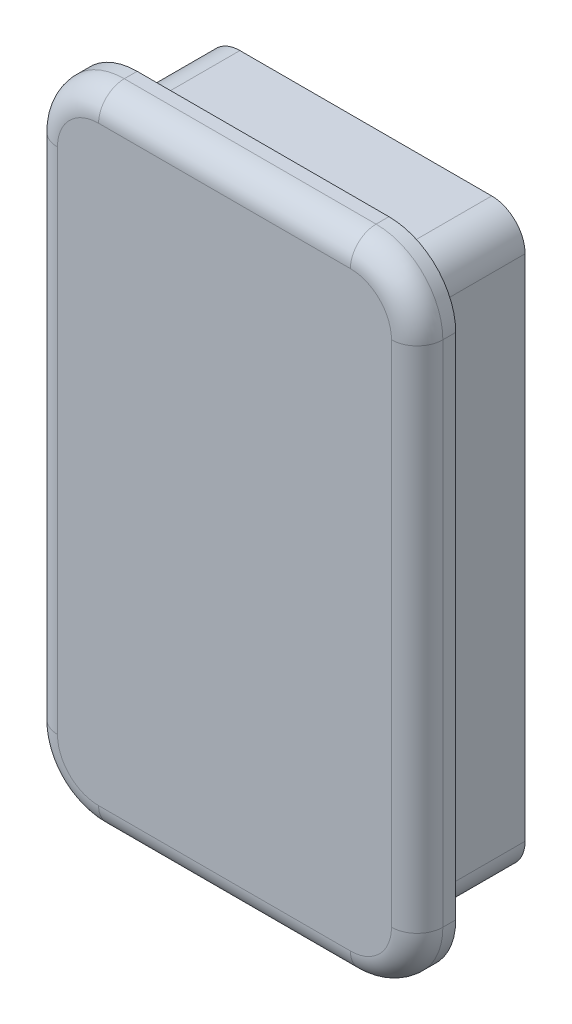
ISO-10303-21;
HEADER;
FILE_DESCRIPTION(('STEP AP214'),'2;1');
FILE_NAME('part.step','',(''),(''),'','','');
FILE_SCHEMA(('AUTOMOTIVE_DESIGN { 1 0 10303 214 1 1 1 1 }'));
ENDSEC;
DATA;
#1=APPLICATION_CONTEXT('core data for automotive mechanical design processes');
#2=APPLICATION_PROTOCOL_DEFINITION('international standard','automotive_design',2000,#1);
#3=PRODUCT_CONTEXT('',#1,'mechanical');
#4=PRODUCT('Part','Part','',(#3));
#5=PRODUCT_RELATED_PRODUCT_CATEGORY('part','',(#4));
#6=PRODUCT_DEFINITION_FORMATION('','',#4);
#7=PRODUCT_DEFINITION_CONTEXT('part definition',#1,'design');
#8=PRODUCT_DEFINITION('design','',#6,#7);
#9=PRODUCT_DEFINITION_SHAPE('','',#8);
#10=(LENGTH_UNIT() NAMED_UNIT(*) SI_UNIT(.MILLI.,.METRE.));
#11=(NAMED_UNIT(*) PLANE_ANGLE_UNIT() SI_UNIT($,.RADIAN.));
#12=(NAMED_UNIT(*) SI_UNIT($,.STERADIAN.) SOLID_ANGLE_UNIT());
#13=UNCERTAINTY_MEASURE_WITH_UNIT(LENGTH_MEASURE(1.E-05),#10,'distance_accuracy_value','');
#14=(GEOMETRIC_REPRESENTATION_CONTEXT(3) GLOBAL_UNCERTAINTY_ASSIGNED_CONTEXT((#13)) GLOBAL_UNIT_ASSIGNED_CONTEXT((#10,
#11,#12)) REPRESENTATION_CONTEXT('',''));
#15=CARTESIAN_POINT('',(0.,0.,0.));
#16=DIRECTION('',(0.,0.,1.));
#17=DIRECTION('',(1.,0.,0.));
#18=AXIS2_PLACEMENT_3D('',#15,#16,#17);
#19=CARTESIAN_POINT('',(9.8,19.8,-8.));
#20=DIRECTION('',(0.,0.,1.));
#21=DIRECTION('',(1.,0.,0.));
#22=AXIS2_PLACEMENT_3D('',#19,#20,#21);
#23=CYLINDRICAL_SURFACE('',#22,2.6);
#24=CARTESIAN_POINT('',(9.8,19.8,0.));
#25=DIRECTION('',(0.,0.,1.));
#26=DIRECTION('',(1.,0.,0.));
#27=AXIS2_PLACEMENT_3D('',#24,#25,#26);
#28=CIRCLE('',#27,2.6);
#29=CARTESIAN_POINT('',(12.4,19.8,0.));
#30=VERTEX_POINT('',#29);
#31=CARTESIAN_POINT('',(9.8,22.4,0.));
#32=VERTEX_POINT('',#31);
#33=EDGE_CURVE('E419',#30,#32,#28,.T.);
#34=ORIENTED_EDGE('',*,*,#33,.F.);
#35=DIRECTION('',(0.,0.,1.));
#36=VECTOR('',#35,1.);
#37=CARTESIAN_POINT('',(12.4,19.8,-8.));
#38=LINE('',#37,#36);
#39=CARTESIAN_POINT('',(12.4,19.8,-8.));
#40=VERTEX_POINT('',#39);
#41=EDGE_CURVE('E476',#40,#30,#38,.T.);
#42=ORIENTED_EDGE('',*,*,#41,.F.);
#43=CARTESIAN_POINT('',(9.8,19.8,-8.));
#44=DIRECTION('',(0.,0.,1.));
#45=DIRECTION('',(1.,0.,0.));
#46=AXIS2_PLACEMENT_3D('',#43,#44,#45);
#47=CIRCLE('',#46,2.6);
#48=CARTESIAN_POINT('',(9.8,22.4,-8.));
#49=VERTEX_POINT('',#48);
#50=EDGE_CURVE('E420',#40,#49,#47,.T.);
#51=ORIENTED_EDGE('',*,*,#50,.T.);
#52=DIRECTION('',(0.,0.,1.));
#53=VECTOR('',#52,1.);
#54=CARTESIAN_POINT('',(9.8,22.4,-8.));
#55=LINE('',#54,#53);
#56=EDGE_CURVE('E451',#49,#32,#55,.T.);
#57=ORIENTED_EDGE('',*,*,#56,.T.);
#58=EDGE_LOOP('',(#34,#42,#51,#57));
#59=FACE_BOUND('',#58,.T.);
#60=ADVANCED_FACE('F38',(#59),#23,.T.);
#61=CARTESIAN_POINT('',(12.4,19.8,-8.));
#62=DIRECTION('',(-1.,0.,0.));
#63=DIRECTION('',(0.,0.,1.));
#64=AXIS2_PLACEMENT_3D('',#61,#62,#63);
#65=PLANE('',#64);
#66=DIRECTION('',(0.,-1.,0.));
#67=VECTOR('',#66,1.);
#68=CARTESIAN_POINT('',(12.4,19.8,0.));
#69=LINE('',#68,#67);
#70=CARTESIAN_POINT('',(12.4,-19.8,0.));
#71=VERTEX_POINT('',#70);
#72=EDGE_CURVE('E425',#30,#71,#69,.T.);
#73=ORIENTED_EDGE('',*,*,#72,.T.);
#74=DIRECTION('',(0.,0.,1.));
#75=VECTOR('',#74,1.);
#76=CARTESIAN_POINT('',(12.4,-19.8,-8.));
#77=LINE('',#76,#75);
#78=CARTESIAN_POINT('',(12.4,-19.8,-8.));
#79=VERTEX_POINT('',#78);
#80=EDGE_CURVE('E481',#79,#71,#77,.T.);
#81=ORIENTED_EDGE('',*,*,#80,.F.);
#82=DIRECTION('',(0.,-1.,0.));
#83=VECTOR('',#82,1.);
#84=CARTESIAN_POINT('',(12.4,19.8,-8.));
#85=LINE('',#84,#83);
#86=EDGE_CURVE('E448',#40,#79,#85,.T.);
#87=ORIENTED_EDGE('',*,*,#86,.F.);
#88=ORIENTED_EDGE('',*,*,#41,.T.);
#89=EDGE_LOOP('',(#73,#81,#87,#88));
#90=FACE_BOUND('',#89,.T.);
#91=ADVANCED_FACE('F660',(#90),#65,.F.);
#92=CARTESIAN_POINT('',(9.8,-19.8,-8.));
#93=DIRECTION('',(0.,0.,1.));
#94=DIRECTION('',(1.,0.,0.));
#95=AXIS2_PLACEMENT_3D('',#92,#93,#94);
#96=CYLINDRICAL_SURFACE('',#95,2.6);
#97=CARTESIAN_POINT('',(9.8,-19.8,0.));
#98=DIRECTION('',(0.,0.,1.));
#99=DIRECTION('',(1.,0.,0.));
#100=AXIS2_PLACEMENT_3D('',#97,#98,#99);
#101=CIRCLE('',#100,2.6);
#102=CARTESIAN_POINT('',(9.8,-22.4,0.));
#103=VERTEX_POINT('',#102);
#104=EDGE_CURVE('E470',#103,#71,#101,.T.);
#105=ORIENTED_EDGE('',*,*,#104,.F.);
#106=DIRECTION('',(0.,0.,1.));
#107=VECTOR('',#106,1.);
#108=CARTESIAN_POINT('',(9.8,-22.4,-8.));
#109=LINE('',#108,#107);
#110=CARTESIAN_POINT('',(9.8,-22.4,-8.));
#111=VERTEX_POINT('',#110);
#112=EDGE_CURVE('E485',#111,#103,#109,.T.);
#113=ORIENTED_EDGE('',*,*,#112,.F.);
#114=CARTESIAN_POINT('',(9.8,-19.8,-8.));
#115=DIRECTION('',(0.,0.,1.));
#116=DIRECTION('',(1.,0.,0.));
#117=AXIS2_PLACEMENT_3D('',#114,#115,#116);
#118=CIRCLE('',#117,2.6);
#119=EDGE_CURVE('E444',#111,#79,#118,.T.);
#120=ORIENTED_EDGE('',*,*,#119,.T.);
#121=ORIENTED_EDGE('',*,*,#80,.T.);
#122=EDGE_LOOP('',(#105,#113,#120,#121));
#123=FACE_BOUND('',#122,.T.);
#124=ADVANCED_FACE('F665',(#123),#96,.T.);
#125=CARTESIAN_POINT('',(-9.8,-22.4,-8.));
#126=DIRECTION('',(0.,-1.,0.));
#127=DIRECTION('',(0.,0.,-1.));
#128=AXIS2_PLACEMENT_3D('',#125,#126,#127);
#129=PLANE('',#128);
#130=DIRECTION('',(1.,0.,0.));
#131=VECTOR('',#130,1.);
#132=CARTESIAN_POINT('',(-9.8,-22.4,0.));
#133=LINE('',#132,#131);
#134=CARTESIAN_POINT('',(-9.8,-22.4,0.));
#135=VERTEX_POINT('',#134);
#136=EDGE_CURVE('E467',#135,#103,#133,.T.);
#137=ORIENTED_EDGE('',*,*,#136,.F.);
#138=DIRECTION('',(0.,0.,1.));
#139=VECTOR('',#138,1.);
#140=CARTESIAN_POINT('',(-9.8,-22.4,-8.));
#141=LINE('',#140,#139);
#142=CARTESIAN_POINT('',(-9.8,-22.4,-8.));
#143=VERTEX_POINT('',#142);
#144=EDGE_CURVE('E489',#143,#135,#141,.T.);
#145=ORIENTED_EDGE('',*,*,#144,.F.);
#146=DIRECTION('',(1.,0.,0.));
#147=VECTOR('',#146,1.);
#148=CARTESIAN_POINT('',(-9.8,-22.4,-8.));
#149=LINE('',#148,#147);
#150=EDGE_CURVE('E440',#143,#111,#149,.T.);
#151=ORIENTED_EDGE('',*,*,#150,.T.);
#152=ORIENTED_EDGE('',*,*,#112,.T.);
#153=EDGE_LOOP('',(#137,#145,#151,#152));
#154=FACE_BOUND('',#153,.T.);
#155=ADVANCED_FACE('F685',(#154),#129,.T.);
#156=CARTESIAN_POINT('',(-9.8,-19.8,-8.));
#157=DIRECTION('',(0.,0.,1.));
#158=DIRECTION('',(1.,0.,0.));
#159=AXIS2_PLACEMENT_3D('',#156,#157,#158);
#160=CYLINDRICAL_SURFACE('',#159,2.6);
#161=CARTESIAN_POINT('',(-9.8,-19.8,0.));
#162=DIRECTION('',(0.,0.,1.));
#163=DIRECTION('',(1.,0.,0.));
#164=AXIS2_PLACEMENT_3D('',#161,#162,#163);
#165=CIRCLE('',#164,2.6);
#166=CARTESIAN_POINT('',(-12.4,-19.8,0.));
#167=VERTEX_POINT('',#166);
#168=EDGE_CURVE('E464',#167,#135,#165,.T.);
#169=ORIENTED_EDGE('',*,*,#168,.F.);
#170=DIRECTION('',(0.,0.,1.));
#171=VECTOR('',#170,1.);
#172=CARTESIAN_POINT('',(-12.4,-19.8,-8.));
#173=LINE('',#172,#171);
#174=CARTESIAN_POINT('',(-12.4,-19.8,-8.));
#175=VERTEX_POINT('',#174);
#176=EDGE_CURVE('E493',#175,#167,#173,.T.);
#177=ORIENTED_EDGE('',*,*,#176,.F.);
#178=CARTESIAN_POINT('',(-9.8,-19.8,-8.));
#179=DIRECTION('',(0.,0.,1.));
#180=DIRECTION('',(1.,0.,0.));
#181=AXIS2_PLACEMENT_3D('',#178,#179,#180);
#182=CIRCLE('',#181,2.6);
#183=EDGE_CURVE('E436',#175,#143,#182,.T.);
#184=ORIENTED_EDGE('',*,*,#183,.T.);
#185=ORIENTED_EDGE('',*,*,#144,.T.);
#186=EDGE_LOOP('',(#169,#177,#184,#185));
#187=FACE_BOUND('',#186,.T.);
#188=ADVANCED_FACE('F681',(#187),#160,.T.);
#189=CARTESIAN_POINT('',(-12.4,-19.8,-8.));
#190=DIRECTION('',(1.,0.,0.));
#191=DIRECTION('',(0.,0.,-1.));
#192=AXIS2_PLACEMENT_3D('',#189,#190,#191);
#193=PLANE('',#192);
#194=DIRECTION('',(0.,1.,0.));
#195=VECTOR('',#194,1.);
#196=CARTESIAN_POINT('',(-12.4,-19.8,0.));
#197=LINE('',#196,#195);
#198=CARTESIAN_POINT('',(-12.4,19.8,0.));
#199=VERTEX_POINT('',#198);
#200=EDGE_CURVE('E460',#167,#199,#197,.T.);
#201=ORIENTED_EDGE('',*,*,#200,.T.);
#202=DIRECTION('',(0.,0.,1.));
#203=VECTOR('',#202,1.);
#204=CARTESIAN_POINT('',(-12.4,19.8,-8.));
#205=LINE('',#204,#203);
#206=CARTESIAN_POINT('',(-12.4,19.8,-8.));
#207=VERTEX_POINT('',#206);
#208=EDGE_CURVE('E497',#207,#199,#205,.T.);
#209=ORIENTED_EDGE('',*,*,#208,.F.);
#210=DIRECTION('',(0.,1.,0.));
#211=VECTOR('',#210,1.);
#212=CARTESIAN_POINT('',(-12.4,-19.8,-8.));
#213=LINE('',#212,#211);
#214=EDGE_CURVE('E433',#175,#207,#213,.T.);
#215=ORIENTED_EDGE('',*,*,#214,.F.);
#216=ORIENTED_EDGE('',*,*,#176,.T.);
#217=EDGE_LOOP('',(#201,#209,#215,#216));
#218=FACE_BOUND('',#217,.T.);
#219=ADVANCED_FACE('F677',(#218),#193,.F.);
#220=CARTESIAN_POINT('',(-9.8,19.8,-8.));
#221=DIRECTION('',(0.,0.,1.));
#222=DIRECTION('',(1.,0.,0.));
#223=AXIS2_PLACEMENT_3D('',#220,#221,#222);
#224=CYLINDRICAL_SURFACE('',#223,2.6);
#225=CARTESIAN_POINT('',(-9.8,19.8,0.));
#226=DIRECTION('',(0.,0.,1.));
#227=DIRECTION('',(1.,0.,0.));
#228=AXIS2_PLACEMENT_3D('',#225,#226,#227);
#229=CIRCLE('',#228,2.6);
#230=CARTESIAN_POINT('',(-9.8,22.4,0.));
#231=VERTEX_POINT('',#230);
#232=EDGE_CURVE('E457',#231,#199,#229,.T.);
#233=ORIENTED_EDGE('',*,*,#232,.F.);
#234=DIRECTION('',(0.,0.,1.));
#235=VECTOR('',#234,1.);
#236=CARTESIAN_POINT('',(-9.8,22.4,-8.));
#237=LINE('',#236,#235);
#238=CARTESIAN_POINT('',(-9.8,22.4,-8.));
#239=VERTEX_POINT('',#238);
#240=EDGE_CURVE('E501',#239,#231,#237,.T.);
#241=ORIENTED_EDGE('',*,*,#240,.F.);
#242=CARTESIAN_POINT('',(-9.8,19.8,-8.));
#243=DIRECTION('',(0.,0.,1.));
#244=DIRECTION('',(1.,0.,0.));
#245=AXIS2_PLACEMENT_3D('',#242,#243,#244);
#246=CIRCLE('',#245,2.6);
#247=EDGE_CURVE('E429',#239,#207,#246,.T.);
#248=ORIENTED_EDGE('',*,*,#247,.T.);
#249=ORIENTED_EDGE('',*,*,#208,.T.);
#250=EDGE_LOOP('',(#233,#241,#248,#249));
#251=FACE_BOUND('',#250,.T.);
#252=ADVANCED_FACE('F673',(#251),#224,.T.);
#253=CARTESIAN_POINT('',(9.8,22.4,-8.));
#254=DIRECTION('',(0.,1.,0.));
#255=DIRECTION('',(0.,0.,1.));
#256=AXIS2_PLACEMENT_3D('',#253,#254,#255);
#257=PLANE('',#256);
#258=DIRECTION('',(-1.,0.,0.));
#259=VECTOR('',#258,1.);
#260=CARTESIAN_POINT('',(9.8,22.4,0.));
#261=LINE('',#260,#259);
#262=EDGE_CURVE('E454',#32,#231,#261,.T.);
#263=ORIENTED_EDGE('',*,*,#262,.F.);
#264=ORIENTED_EDGE('',*,*,#56,.F.);
#265=DIRECTION('',(-1.,0.,0.));
#266=VECTOR('',#265,1.);
#267=CARTESIAN_POINT('',(9.8,22.4,-8.));
#268=LINE('',#267,#266);
#269=EDGE_CURVE('E424',#49,#239,#268,.T.);
#270=ORIENTED_EDGE('',*,*,#269,.T.);
#271=ORIENTED_EDGE('',*,*,#240,.T.);
#272=EDGE_LOOP('',(#263,#264,#270,#271));
#273=FACE_BOUND('',#272,.T.);
#274=ADVANCED_FACE('F670',(#273),#257,.T.);
#275=CARTESIAN_POINT('',(9.8,19.8,-8.));
#276=DIRECTION('',(0.,0.,1.));
#277=DIRECTION('',(1.,0.,0.));
#278=AXIS2_PLACEMENT_3D('',#275,#276,#277);
#279=PLANE('',#278);
#280=DIRECTION('',(0.,-1.,0.));
#281=VECTOR('',#280,1.);
#282=CARTESIAN_POINT('',(10.4,19.8,-8.));
#283=LINE('',#282,#281);
#284=CARTESIAN_POINT('',(10.4,19.8,-8.));
#285=VERTEX_POINT('',#284);
#286=CARTESIAN_POINT('',(10.4,-19.8,-8.));
#287=VERTEX_POINT('',#286);
#288=EDGE_CURVE('E287',#285,#287,#283,.T.);
#289=ORIENTED_EDGE('',*,*,#288,.F.);
#290=CARTESIAN_POINT('',(9.8,19.8,-8.));
#291=DIRECTION('',(0.,0.,1.));
#292=DIRECTION('',(1.,0.,0.));
#293=AXIS2_PLACEMENT_3D('',#290,#291,#292);
#294=CIRCLE('',#293,0.599999999999997);
#295=CARTESIAN_POINT('',(9.8,20.4,-8.));
#296=VERTEX_POINT('',#295);
#297=EDGE_CURVE('E296',#285,#296,#294,.T.);
#298=ORIENTED_EDGE('',*,*,#297,.T.);
#299=DIRECTION('',(-1.,0.,0.));
#300=VECTOR('',#299,1.);
#301=CARTESIAN_POINT('',(9.8,20.4,-8.));
#302=LINE('',#301,#300);
#303=CARTESIAN_POINT('',(-9.8,20.4,-8.));
#304=VERTEX_POINT('',#303);
#305=EDGE_CURVE('E304',#296,#304,#302,.T.);
#306=ORIENTED_EDGE('',*,*,#305,.T.);
#307=CARTESIAN_POINT('',(-9.8,19.8,-8.));
#308=DIRECTION('',(0.,0.,1.));
#309=DIRECTION('',(1.,0.,0.));
#310=AXIS2_PLACEMENT_3D('',#307,#308,#309);
#311=CIRCLE('',#310,0.599999999999997);
#312=CARTESIAN_POINT('',(-10.4,19.8,-8.));
#313=VERTEX_POINT('',#312);
#314=EDGE_CURVE('E59',#304,#313,#311,.T.);
#315=ORIENTED_EDGE('',*,*,#314,.T.);
#316=DIRECTION('',(0.,1.,0.));
#317=VECTOR('',#316,1.);
#318=CARTESIAN_POINT('',(-10.4,19.8,-8.));
#319=LINE('',#318,#317);
#320=CARTESIAN_POINT('',(-10.4,-19.8,-8.));
#321=VERTEX_POINT('',#320);
#322=EDGE_CURVE('E330',#321,#313,#319,.T.);
#323=ORIENTED_EDGE('',*,*,#322,.F.);
#324=CARTESIAN_POINT('',(-9.8,-19.8,-8.));
#325=DIRECTION('',(0.,0.,1.));
#326=DIRECTION('',(1.,0.,0.));
#327=AXIS2_PLACEMENT_3D('',#324,#325,#326);
#328=CIRCLE('',#327,0.599999999999997);
#329=CARTESIAN_POINT('',(-9.8,-20.4,-8.));
#330=VERTEX_POINT('',#329);
#331=EDGE_CURVE('E326',#321,#330,#328,.T.);
#332=ORIENTED_EDGE('',*,*,#331,.T.);
#333=DIRECTION('',(1.,0.,0.));
#334=VECTOR('',#333,1.);
#335=CARTESIAN_POINT('',(9.8,-20.4,-8.));
#336=LINE('',#335,#334);
#337=CARTESIAN_POINT('',(9.8,-20.4,-8.));
#338=VERTEX_POINT('',#337);
#339=EDGE_CURVE('E320',#330,#338,#336,.T.);
#340=ORIENTED_EDGE('',*,*,#339,.T.);
#341=CARTESIAN_POINT('',(9.8,-19.8,-8.));
#342=DIRECTION('',(0.,0.,1.));
#343=DIRECTION('',(1.,0.,0.));
#344=AXIS2_PLACEMENT_3D('',#341,#342,#343);
#345=CIRCLE('',#344,0.599999999999997);
#346=EDGE_CURVE('E311',#338,#287,#345,.T.);
#347=ORIENTED_EDGE('',*,*,#346,.T.);
#348=EDGE_LOOP('',(#289,#298,#306,#315,#323,#332,#340,#347));
#349=FACE_BOUND('',#348,.T.);
#350=ORIENTED_EDGE('',*,*,#50,.F.);
#351=ORIENTED_EDGE('',*,*,#86,.T.);
#352=ORIENTED_EDGE('',*,*,#119,.F.);
#353=ORIENTED_EDGE('',*,*,#150,.F.);
#354=ORIENTED_EDGE('',*,*,#183,.F.);
#355=ORIENTED_EDGE('',*,*,#214,.T.);
#356=ORIENTED_EDGE('',*,*,#247,.F.);
#357=ORIENTED_EDGE('',*,*,#269,.F.);
#358=EDGE_LOOP('',(#350,#351,#352,#353,#354,#355,#356,#357));
#359=FACE_BOUND('',#358,.T.);
#360=ADVANCED_FACE('F307',(#349,#359),#279,.F.);
#361=CARTESIAN_POINT('',(9.8,19.8,0.));
#362=DIRECTION('',(0.,0.,1.));
#363=DIRECTION('',(1.,0.,0.));
#364=AXIS2_PLACEMENT_3D('',#361,#362,#363);
#365=PLANE('',#364);
#366=CARTESIAN_POINT('',(9.8,19.8,0.));
#367=DIRECTION('',(0.,0.,1.));
#368=DIRECTION('',(1.,0.,0.));
#369=AXIS2_PLACEMENT_3D('',#366,#367,#368);
#370=CIRCLE('',#369,5.2);
#371=CARTESIAN_POINT('',(15.,19.8,0.));
#372=VERTEX_POINT('',#371);
#373=CARTESIAN_POINT('',(9.8,25.,0.));
#374=VERTEX_POINT('',#373);
#375=EDGE_CURVE('E363',#372,#374,#370,.T.);
#376=ORIENTED_EDGE('',*,*,#375,.F.);
#377=DIRECTION('',(0.,1.,0.));
#378=VECTOR('',#377,1.);
#379=CARTESIAN_POINT('',(15.,19.8,0.));
#380=LINE('',#379,#378);
#381=CARTESIAN_POINT('',(15.,-19.8,0.));
#382=VERTEX_POINT('',#381);
#383=EDGE_CURVE('E391',#382,#372,#380,.T.);
#384=ORIENTED_EDGE('',*,*,#383,.F.);
#385=CARTESIAN_POINT('',(9.8,-19.8,0.));
#386=DIRECTION('',(0.,0.,1.));
#387=DIRECTION('',(1.,0.,0.));
#388=AXIS2_PLACEMENT_3D('',#385,#386,#387);
#389=CIRCLE('',#388,5.2);
#390=CARTESIAN_POINT('',(9.8,-25.,0.));
#391=VERTEX_POINT('',#390);
#392=EDGE_CURVE('E387',#391,#382,#389,.T.);
#393=ORIENTED_EDGE('',*,*,#392,.F.);
#394=DIRECTION('',(1.,0.,0.));
#395=VECTOR('',#394,1.);
#396=CARTESIAN_POINT('',(-9.8,-25.,0.));
#397=LINE('',#396,#395);
#398=CARTESIAN_POINT('',(-9.8,-25.,0.));
#399=VERTEX_POINT('',#398);
#400=EDGE_CURVE('E383',#399,#391,#397,.T.);
#401=ORIENTED_EDGE('',*,*,#400,.F.);
#402=CARTESIAN_POINT('',(-9.8,-19.8,0.));
#403=DIRECTION('',(0.,0.,1.));
#404=DIRECTION('',(1.,0.,0.));
#405=AXIS2_PLACEMENT_3D('',#402,#403,#404);
#406=CIRCLE('',#405,5.2);
#407=CARTESIAN_POINT('',(-15.,-19.8,0.));
#408=VERTEX_POINT('',#407);
#409=EDGE_CURVE('E379',#408,#399,#406,.T.);
#410=ORIENTED_EDGE('',*,*,#409,.F.);
#411=DIRECTION('',(0.,-1.,0.));
#412=VECTOR('',#411,1.);
#413=CARTESIAN_POINT('',(-15.,-19.8,0.));
#414=LINE('',#413,#412);
#415=CARTESIAN_POINT('',(-15.,19.8,0.));
#416=VERTEX_POINT('',#415);
#417=EDGE_CURVE('E375',#416,#408,#414,.T.);
#418=ORIENTED_EDGE('',*,*,#417,.F.);
#419=CARTESIAN_POINT('',(-9.8,19.8,0.));
#420=DIRECTION('',(0.,0.,1.));
#421=DIRECTION('',(1.,0.,0.));
#422=AXIS2_PLACEMENT_3D('',#419,#420,#421);
#423=CIRCLE('',#422,5.2);
#424=CARTESIAN_POINT('',(-9.8,25.,0.));
#425=VERTEX_POINT('',#424);
#426=EDGE_CURVE('E371',#425,#416,#423,.T.);
#427=ORIENTED_EDGE('',*,*,#426,.F.);
#428=DIRECTION('',(-1.,0.,0.));
#429=VECTOR('',#428,1.);
#430=CARTESIAN_POINT('',(9.8,25.,0.));
#431=LINE('',#430,#429);
#432=EDGE_CURVE('E367',#374,#425,#431,.T.);
#433=ORIENTED_EDGE('',*,*,#432,.F.);
#434=EDGE_LOOP('',(#376,#384,#393,#401,#410,#418,#427,#433));
#435=FACE_BOUND('',#434,.T.);
#436=ORIENTED_EDGE('',*,*,#72,.F.);
#437=ORIENTED_EDGE('',*,*,#33,.T.);
#438=ORIENTED_EDGE('',*,*,#262,.T.);
#439=ORIENTED_EDGE('',*,*,#232,.T.);
#440=ORIENTED_EDGE('',*,*,#200,.F.);
#441=ORIENTED_EDGE('',*,*,#168,.T.);
#442=ORIENTED_EDGE('',*,*,#136,.T.);
#443=ORIENTED_EDGE('',*,*,#104,.T.);
#444=EDGE_LOOP('',(#436,#437,#438,#439,#440,#441,#442,#443));
#445=FACE_BOUND('',#444,.T.);
#446=ADVANCED_FACE('F602',(#435,#445),#365,.F.);
#447=CARTESIAN_POINT('',(9.8,19.8,3.));
#448=DIRECTION('',(0.,0.,-1.));
#449=DIRECTION('',(-1.,0.,0.));
#450=AXIS2_PLACEMENT_3D('',#447,#448,#449);
#451=CYLINDRICAL_SURFACE('',#450,5.2);
#452=DIRECTION('',(0.,0.,-1.));
#453=VECTOR('',#452,1.);
#454=CARTESIAN_POINT('',(9.8,25.,3.));
#455=LINE('',#454,#453);
#456=CARTESIAN_POINT('',(9.8,25.,1.));
#457=VERTEX_POINT('',#456);
#458=EDGE_CURVE('E416',#457,#374,#455,.T.);
#459=ORIENTED_EDGE('',*,*,#458,.F.);
#460=CARTESIAN_POINT('',(9.8,19.8,1.));
#461=DIRECTION('',(0.,0.,1.));
#462=DIRECTION('',(1.,0.,0.));
#463=AXIS2_PLACEMENT_3D('',#460,#461,#462);
#464=CIRCLE('',#463,5.2);
#465=CARTESIAN_POINT('',(15.,19.8,1.));
#466=VERTEX_POINT('',#465);
#467=EDGE_CURVE('E48',#457,#466,#464,.F.);
#468=ORIENTED_EDGE('',*,*,#467,.T.);
#469=DIRECTION('',(0.,0.,-1.));
#470=VECTOR('',#469,1.);
#471=CARTESIAN_POINT('',(15.,19.8,3.));
#472=LINE('',#471,#470);
#473=EDGE_CURVE('E395',#466,#372,#472,.T.);
#474=ORIENTED_EDGE('',*,*,#473,.T.);
#475=ORIENTED_EDGE('',*,*,#375,.T.);
#476=EDGE_LOOP('',(#459,#468,#474,#475));
#477=FACE_BOUND('',#476,.T.);
#478=ADVANCED_FACE('F695',(#477),#451,.T.);
#479=CARTESIAN_POINT('',(9.8,25.,3.));
#480=DIRECTION('',(0.,-1.,0.));
#481=DIRECTION('',(0.,0.,-1.));
#482=AXIS2_PLACEMENT_3D('',#479,#480,#481);
#483=PLANE('',#482);
#484=DIRECTION('',(0.,0.,-1.));
#485=VECTOR('',#484,1.);
#486=CARTESIAN_POINT('',(-9.8,25.,3.));
#487=LINE('',#486,#485);
#488=CARTESIAN_POINT('',(-9.8,25.,1.));
#489=VERTEX_POINT('',#488);
#490=EDGE_CURVE('E413',#489,#425,#487,.T.);
#491=ORIENTED_EDGE('',*,*,#490,.F.);
#492=DIRECTION('',(-1.,0.,0.));
#493=VECTOR('',#492,1.);
#494=CARTESIAN_POINT('',(9.8,25.,1.));
#495=LINE('',#494,#493);
#496=EDGE_CURVE('E548',#489,#457,#495,.F.);
#497=ORIENTED_EDGE('',*,*,#496,.T.);
#498=ORIENTED_EDGE('',*,*,#458,.T.);
#499=ORIENTED_EDGE('',*,*,#432,.T.);
#500=EDGE_LOOP('',(#491,#497,#498,#499));
#501=FACE_BOUND('',#500,.T.);
#502=ADVANCED_FACE('F596',(#501),#483,.F.);
#503=CARTESIAN_POINT('',(-9.8,19.8,3.));
#504=DIRECTION('',(0.,0.,-1.));
#505=DIRECTION('',(-1.,0.,0.));
#506=AXIS2_PLACEMENT_3D('',#503,#504,#505);
#507=CYLINDRICAL_SURFACE('',#506,5.2);
#508=DIRECTION('',(0.,0.,-1.));
#509=VECTOR('',#508,1.);
#510=CARTESIAN_POINT('',(-15.,19.8,3.));
#511=LINE('',#510,#509);
#512=CARTESIAN_POINT('',(-15.,19.8,1.));
#513=VERTEX_POINT('',#512);
#514=EDGE_CURVE('E410',#513,#416,#511,.T.);
#515=ORIENTED_EDGE('',*,*,#514,.F.);
#516=CARTESIAN_POINT('',(-9.8,19.8,1.));
#517=DIRECTION('',(0.,0.,1.));
#518=DIRECTION('',(1.,0.,0.));
#519=AXIS2_PLACEMENT_3D('',#516,#517,#518);
#520=CIRCLE('',#519,5.2);
#521=EDGE_CURVE('E545',#513,#489,#520,.F.);
#522=ORIENTED_EDGE('',*,*,#521,.T.);
#523=ORIENTED_EDGE('',*,*,#490,.T.);
#524=ORIENTED_EDGE('',*,*,#426,.T.);
#525=EDGE_LOOP('',(#515,#522,#523,#524));
#526=FACE_BOUND('',#525,.T.);
#527=ADVANCED_FACE('F594',(#526),#507,.T.);
#528=CARTESIAN_POINT('',(-15.,-19.8,3.));
#529=DIRECTION('',(1.,0.,0.));
#530=DIRECTION('',(0.,0.,-1.));
#531=AXIS2_PLACEMENT_3D('',#528,#529,#530);
#532=PLANE('',#531);
#533=DIRECTION('',(0.,0.,-1.));
#534=VECTOR('',#533,1.);
#535=CARTESIAN_POINT('',(-15.,-19.8,3.));
#536=LINE('',#535,#534);
#537=CARTESIAN_POINT('',(-15.,-19.8,1.));
#538=VERTEX_POINT('',#537);
#539=EDGE_CURVE('E407',#538,#408,#536,.T.);
#540=ORIENTED_EDGE('',*,*,#539,.F.);
#541=DIRECTION('',(0.,-1.,0.));
#542=VECTOR('',#541,1.);
#543=CARTESIAN_POINT('',(-15.,19.8,1.));
#544=LINE('',#543,#542);
#545=EDGE_CURVE('E542',#538,#513,#544,.F.);
#546=ORIENTED_EDGE('',*,*,#545,.T.);
#547=ORIENTED_EDGE('',*,*,#514,.T.);
#548=ORIENTED_EDGE('',*,*,#417,.T.);
#549=EDGE_LOOP('',(#540,#546,#547,#548));
#550=FACE_BOUND('',#549,.T.);
#551=ADVANCED_FACE('F608',(#550),#532,.F.);
#552=CARTESIAN_POINT('',(-9.8,-19.8,3.));
#553=DIRECTION('',(0.,0.,-1.));
#554=DIRECTION('',(-1.,0.,0.));
#555=AXIS2_PLACEMENT_3D('',#552,#553,#554);
#556=CYLINDRICAL_SURFACE('',#555,5.2);
#557=DIRECTION('',(0.,0.,-1.));
#558=VECTOR('',#557,1.);
#559=CARTESIAN_POINT('',(-9.8,-25.,3.));
#560=LINE('',#559,#558);
#561=CARTESIAN_POINT('',(-9.8,-25.,1.));
#562=VERTEX_POINT('',#561);
#563=EDGE_CURVE('E404',#562,#399,#560,.T.);
#564=ORIENTED_EDGE('',*,*,#563,.F.);
#565=CARTESIAN_POINT('',(-9.8,-19.8,1.));
#566=DIRECTION('',(0.,0.,1.));
#567=DIRECTION('',(1.,0.,0.));
#568=AXIS2_PLACEMENT_3D('',#565,#566,#567);
#569=CIRCLE('',#568,5.2);
#570=EDGE_CURVE('E539',#562,#538,#569,.F.);
#571=ORIENTED_EDGE('',*,*,#570,.T.);
#572=ORIENTED_EDGE('',*,*,#539,.T.);
#573=ORIENTED_EDGE('',*,*,#409,.T.);
#574=EDGE_LOOP('',(#564,#571,#572,#573));
#575=FACE_BOUND('',#574,.T.);
#576=ADVANCED_FACE('F611',(#575),#556,.T.);
#577=CARTESIAN_POINT('',(-9.8,-25.,3.));
#578=DIRECTION('',(0.,1.,0.));
#579=DIRECTION('',(0.,0.,1.));
#580=AXIS2_PLACEMENT_3D('',#577,#578,#579);
#581=PLANE('',#580);
#582=DIRECTION('',(0.,0.,-1.));
#583=VECTOR('',#582,1.);
#584=CARTESIAN_POINT('',(9.8,-25.,3.));
#585=LINE('',#584,#583);
#586=CARTESIAN_POINT('',(9.8,-25.,1.));
#587=VERTEX_POINT('',#586);
#588=EDGE_CURVE('E401',#587,#391,#585,.T.);
#589=ORIENTED_EDGE('',*,*,#588,.F.);
#590=DIRECTION('',(1.,0.,0.));
#591=VECTOR('',#590,1.);
#592=CARTESIAN_POINT('',(-9.8,-25.,1.));
#593=LINE('',#592,#591);
#594=EDGE_CURVE('E536',#587,#562,#593,.F.);
#595=ORIENTED_EDGE('',*,*,#594,.T.);
#596=ORIENTED_EDGE('',*,*,#563,.T.);
#597=ORIENTED_EDGE('',*,*,#400,.T.);
#598=EDGE_LOOP('',(#589,#595,#596,#597));
#599=FACE_BOUND('',#598,.T.);
#600=ADVANCED_FACE('F706',(#599),#581,.F.);
#601=CARTESIAN_POINT('',(9.8,-19.8,3.));
#602=DIRECTION('',(0.,0.,-1.));
#603=DIRECTION('',(-1.,0.,0.));
#604=AXIS2_PLACEMENT_3D('',#601,#602,#603);
#605=CYLINDRICAL_SURFACE('',#604,5.2);
#606=DIRECTION('',(0.,0.,-1.));
#607=VECTOR('',#606,1.);
#608=CARTESIAN_POINT('',(15.,-19.8,3.));
#609=LINE('',#608,#607);
#610=CARTESIAN_POINT('',(15.,-19.8,1.));
#611=VERTEX_POINT('',#610);
#612=EDGE_CURVE('E398',#611,#382,#609,.T.);
#613=ORIENTED_EDGE('',*,*,#612,.F.);
#614=CARTESIAN_POINT('',(9.8,-19.8,1.));
#615=DIRECTION('',(0.,0.,1.));
#616=DIRECTION('',(1.,0.,0.));
#617=AXIS2_PLACEMENT_3D('',#614,#615,#616);
#618=CIRCLE('',#617,5.2);
#619=EDGE_CURVE('E532',#611,#587,#618,.F.);
#620=ORIENTED_EDGE('',*,*,#619,.T.);
#621=ORIENTED_EDGE('',*,*,#588,.T.);
#622=ORIENTED_EDGE('',*,*,#392,.T.);
#623=EDGE_LOOP('',(#613,#620,#621,#622));
#624=FACE_BOUND('',#623,.T.);
#625=ADVANCED_FACE('F641',(#624),#605,.T.);
#626=CARTESIAN_POINT('',(15.,19.8,3.));
#627=DIRECTION('',(-1.,0.,0.));
#628=DIRECTION('',(0.,0.,1.));
#629=AXIS2_PLACEMENT_3D('',#626,#627,#628);
#630=PLANE('',#629);
#631=ORIENTED_EDGE('',*,*,#473,.F.);
#632=DIRECTION('',(0.,1.,0.));
#633=VECTOR('',#632,1.);
#634=CARTESIAN_POINT('',(15.,-19.8,1.));
#635=LINE('',#634,#633);
#636=EDGE_CURVE('E11',#466,#611,#635,.F.);
#637=ORIENTED_EDGE('',*,*,#636,.T.);
#638=ORIENTED_EDGE('',*,*,#612,.T.);
#639=ORIENTED_EDGE('',*,*,#383,.T.);
#640=EDGE_LOOP('',(#631,#637,#638,#639));
#641=FACE_BOUND('',#640,.T.);
#642=ADVANCED_FACE('F638',(#641),#630,.F.);
#643=CARTESIAN_POINT('',(9.8,19.8,3.));
#644=DIRECTION('',(0.,0.,1.));
#645=DIRECTION('',(1.,0.,0.));
#646=AXIS2_PLACEMENT_3D('',#643,#644,#645);
#647=PLANE('',#646);
#648=DIRECTION('',(1.,0.,0.));
#649=VECTOR('',#648,1.);
#650=CARTESIAN_POINT('',(9.8,-23.,3.));
#651=LINE('',#650,#649);
#652=CARTESIAN_POINT('',(-9.8,-23.,3.));
#653=VERTEX_POINT('',#652);
#654=CARTESIAN_POINT('',(9.8,-23.,3.));
#655=VERTEX_POINT('',#654);
#656=EDGE_CURVE('E525',#653,#655,#651,.T.);
#657=ORIENTED_EDGE('',*,*,#656,.T.);
#658=CARTESIAN_POINT('',(9.8,-19.8,3.));
#659=DIRECTION('',(0.,0.,1.));
#660=DIRECTION('',(1.,0.,0.));
#661=AXIS2_PLACEMENT_3D('',#658,#659,#660);
#662=CIRCLE('',#661,3.2);
#663=CARTESIAN_POINT('',(13.,-19.8,3.));
#664=VERTEX_POINT('',#663);
#665=EDGE_CURVE('E528',#655,#664,#662,.T.);
#666=ORIENTED_EDGE('',*,*,#665,.T.);
#667=DIRECTION('',(0.,1.,0.));
#668=VECTOR('',#667,1.);
#669=CARTESIAN_POINT('',(13.,19.8,3.));
#670=LINE('',#669,#668);
#671=CARTESIAN_POINT('',(13.,19.8,3.));
#672=VERTEX_POINT('',#671);
#673=EDGE_CURVE('E480',#664,#672,#670,.T.);
#674=ORIENTED_EDGE('',*,*,#673,.T.);
#675=CARTESIAN_POINT('',(9.8,19.8,3.));
#676=DIRECTION('',(0.,0.,1.));
#677=DIRECTION('',(1.,0.,0.));
#678=AXIS2_PLACEMENT_3D('',#675,#676,#677);
#679=CIRCLE('',#678,3.2);
#680=CARTESIAN_POINT('',(9.8,23.,3.));
#681=VERTEX_POINT('',#680);
#682=EDGE_CURVE('E510',#672,#681,#679,.T.);
#683=ORIENTED_EDGE('',*,*,#682,.T.);
#684=DIRECTION('',(-1.,0.,0.));
#685=VECTOR('',#684,1.);
#686=CARTESIAN_POINT('',(-9.8,23.,3.));
#687=LINE('',#686,#685);
#688=CARTESIAN_POINT('',(-9.8,23.,3.));
#689=VERTEX_POINT('',#688);
#690=EDGE_CURVE('E513',#681,#689,#687,.T.);
#691=ORIENTED_EDGE('',*,*,#690,.T.);
#692=CARTESIAN_POINT('',(-9.8,19.8,3.));
#693=DIRECTION('',(0.,0.,1.));
#694=DIRECTION('',(1.,0.,0.));
#695=AXIS2_PLACEMENT_3D('',#692,#693,#694);
#696=CIRCLE('',#695,3.2);
#697=CARTESIAN_POINT('',(-13.,19.8,3.));
#698=VERTEX_POINT('',#697);
#699=EDGE_CURVE('E516',#689,#698,#696,.T.);
#700=ORIENTED_EDGE('',*,*,#699,.T.);
#701=DIRECTION('',(0.,-1.,0.));
#702=VECTOR('',#701,1.);
#703=CARTESIAN_POINT('',(-13.,-19.8,3.));
#704=LINE('',#703,#702);
#705=CARTESIAN_POINT('',(-13.,-19.8,3.));
#706=VERTEX_POINT('',#705);
#707=EDGE_CURVE('E519',#698,#706,#704,.T.);
#708=ORIENTED_EDGE('',*,*,#707,.T.);
#709=CARTESIAN_POINT('',(-9.8,-19.8,3.));
#710=DIRECTION('',(0.,0.,1.));
#711=DIRECTION('',(1.,0.,0.));
#712=AXIS2_PLACEMENT_3D('',#709,#710,#711);
#713=CIRCLE('',#712,3.2);
#714=EDGE_CURVE('E522',#706,#653,#713,.T.);
#715=ORIENTED_EDGE('',*,*,#714,.T.);
#716=EDGE_LOOP('',(#657,#666,#674,#683,#691,#700,#708,#715));
#717=FACE_BOUND('',#716,.T.);
#718=ADVANCED_FACE('F624',(#717),#647,.T.);
#719=CARTESIAN_POINT('',(-9.8,19.8,1.));
#720=DIRECTION('',(0.,0.,1.));
#721=DIRECTION('',(1.,0.,0.));
#722=AXIS2_PLACEMENT_3D('',#719,#720,#721);
#723=TOROIDAL_SURFACE('',#722,3.2,2.);
#724=CARTESIAN_POINT('',(-9.8,23.,1.));
#725=DIRECTION('',(1.,0.,0.));
#726=DIRECTION('',(0.,0.,-1.));
#727=AXIS2_PLACEMENT_3D('',#724,#725,#726);
#728=CIRCLE('',#727,2.);
#729=EDGE_CURVE('E573',#489,#689,#728,.T.);
#730=ORIENTED_EDGE('',*,*,#729,.F.);
#731=ORIENTED_EDGE('',*,*,#521,.F.);
#732=CARTESIAN_POINT('',(-13.,19.8,1.));
#733=DIRECTION('',(0.,-1.,0.));
#734=DIRECTION('',(0.,0.,-1.));
#735=AXIS2_PLACEMENT_3D('',#732,#733,#734);
#736=CIRCLE('',#735,2.);
#737=EDGE_CURVE('E42',#698,#513,#736,.T.);
#738=ORIENTED_EDGE('',*,*,#737,.F.);
#739=ORIENTED_EDGE('',*,*,#699,.F.);
#740=EDGE_LOOP('',(#730,#731,#738,#739));
#741=FACE_BOUND('',#740,.T.);
#742=ADVANCED_FACE('F40',(#741),#723,.T.);
#743=CARTESIAN_POINT('',(-13.,19.8,1.));
#744=DIRECTION('',(0.,1.,0.));
#745=DIRECTION('',(0.,0.,1.));
#746=AXIS2_PLACEMENT_3D('',#743,#744,#745);
#747=CYLINDRICAL_SURFACE('',#746,2.);
#748=ORIENTED_EDGE('',*,*,#737,.T.);
#749=ORIENTED_EDGE('',*,*,#545,.F.);
#750=CARTESIAN_POINT('',(-13.,-19.8,1.));
#751=DIRECTION('',(0.,-1.,0.));
#752=DIRECTION('',(0.,0.,-1.));
#753=AXIS2_PLACEMENT_3D('',#750,#751,#752);
#754=CIRCLE('',#753,2.);
#755=EDGE_CURVE('E570',#706,#538,#754,.T.);
#756=ORIENTED_EDGE('',*,*,#755,.F.);
#757=ORIENTED_EDGE('',*,*,#707,.F.);
#758=EDGE_LOOP('',(#748,#749,#756,#757));
#759=FACE_BOUND('',#758,.T.);
#760=ADVANCED_FACE('F586',(#759),#747,.T.);
#761=CARTESIAN_POINT('',(9.8,23.,1.));
#762=DIRECTION('',(1.,0.,0.));
#763=DIRECTION('',(0.,0.,-1.));
#764=AXIS2_PLACEMENT_3D('',#761,#762,#763);
#765=CYLINDRICAL_SURFACE('',#764,2.);
#766=ORIENTED_EDGE('',*,*,#729,.T.);
#767=ORIENTED_EDGE('',*,*,#690,.F.);
#768=CARTESIAN_POINT('',(9.8,23.,1.));
#769=DIRECTION('',(1.,0.,0.));
#770=DIRECTION('',(0.,0.,-1.));
#771=AXIS2_PLACEMENT_3D('',#768,#769,#770);
#772=CIRCLE('',#771,2.);
#773=EDGE_CURVE('E566',#457,#681,#772,.T.);
#774=ORIENTED_EDGE('',*,*,#773,.F.);
#775=ORIENTED_EDGE('',*,*,#496,.F.);
#776=EDGE_LOOP('',(#766,#767,#774,#775));
#777=FACE_BOUND('',#776,.T.);
#778=ADVANCED_FACE('F627',(#777),#765,.T.);
#779=CARTESIAN_POINT('',(-9.8,-19.8,1.));
#780=DIRECTION('',(0.,0.,1.));
#781=DIRECTION('',(1.,0.,0.));
#782=AXIS2_PLACEMENT_3D('',#779,#780,#781);
#783=TOROIDAL_SURFACE('',#782,3.2,2.);
#784=ORIENTED_EDGE('',*,*,#755,.T.);
#785=ORIENTED_EDGE('',*,*,#570,.F.);
#786=CARTESIAN_POINT('',(-9.8,-23.,1.));
#787=DIRECTION('',(1.,0.,0.));
#788=DIRECTION('',(0.,0.,-1.));
#789=AXIS2_PLACEMENT_3D('',#786,#787,#788);
#790=CIRCLE('',#789,2.);
#791=EDGE_CURVE('E562',#653,#562,#790,.T.);
#792=ORIENTED_EDGE('',*,*,#791,.F.);
#793=ORIENTED_EDGE('',*,*,#714,.F.);
#794=EDGE_LOOP('',(#784,#785,#792,#793));
#795=FACE_BOUND('',#794,.T.);
#796=ADVANCED_FACE('F615',(#795),#783,.T.);
#797=CARTESIAN_POINT('',(9.8,19.8,1.));
#798=DIRECTION('',(0.,0.,1.));
#799=DIRECTION('',(1.,0.,0.));
#800=AXIS2_PLACEMENT_3D('',#797,#798,#799);
#801=TOROIDAL_SURFACE('',#800,3.2,2.);
#802=ORIENTED_EDGE('',*,*,#773,.T.);
#803=ORIENTED_EDGE('',*,*,#682,.F.);
#804=CARTESIAN_POINT('',(13.,19.8,1.));
#805=DIRECTION('',(0.,-1.,0.));
#806=DIRECTION('',(0.,0.,-1.));
#807=AXIS2_PLACEMENT_3D('',#804,#805,#806);
#808=CIRCLE('',#807,2.);
#809=EDGE_CURVE('E558',#466,#672,#808,.T.);
#810=ORIENTED_EDGE('',*,*,#809,.F.);
#811=ORIENTED_EDGE('',*,*,#467,.F.);
#812=EDGE_LOOP('',(#802,#803,#810,#811));
#813=FACE_BOUND('',#812,.T.);
#814=ADVANCED_FACE('F629',(#813),#801,.T.);
#815=CARTESIAN_POINT('',(9.8,-23.,1.));
#816=DIRECTION('',(-1.,0.,0.));
#817=DIRECTION('',(0.,0.,1.));
#818=AXIS2_PLACEMENT_3D('',#815,#816,#817);
#819=CYLINDRICAL_SURFACE('',#818,2.);
#820=ORIENTED_EDGE('',*,*,#791,.T.);
#821=ORIENTED_EDGE('',*,*,#594,.F.);
#822=CARTESIAN_POINT('',(9.8,-23.,1.));
#823=DIRECTION('',(1.,0.,0.));
#824=DIRECTION('',(0.,0.,-1.));
#825=AXIS2_PLACEMENT_3D('',#822,#823,#824);
#826=CIRCLE('',#825,2.);
#827=EDGE_CURVE('E555',#655,#587,#826,.T.);
#828=ORIENTED_EDGE('',*,*,#827,.F.);
#829=ORIENTED_EDGE('',*,*,#656,.F.);
#830=EDGE_LOOP('',(#820,#821,#828,#829));
#831=FACE_BOUND('',#830,.T.);
#832=ADVANCED_FACE('F620',(#831),#819,.T.);
#833=CARTESIAN_POINT('',(13.,19.8,1.));
#834=DIRECTION('',(0.,-1.,0.));
#835=DIRECTION('',(0.,0.,-1.));
#836=AXIS2_PLACEMENT_3D('',#833,#834,#835);
#837=CYLINDRICAL_SURFACE('',#836,2.);
#838=ORIENTED_EDGE('',*,*,#809,.T.);
#839=ORIENTED_EDGE('',*,*,#673,.F.);
#840=CARTESIAN_POINT('',(13.,-19.8,1.));
#841=DIRECTION('',(0.,-1.,0.));
#842=DIRECTION('',(0.,0.,-1.));
#843=AXIS2_PLACEMENT_3D('',#840,#841,#842);
#844=CIRCLE('',#843,2.);
#845=EDGE_CURVE('E362',#611,#664,#844,.T.);
#846=ORIENTED_EDGE('',*,*,#845,.F.);
#847=ORIENTED_EDGE('',*,*,#636,.F.);
#848=EDGE_LOOP('',(#838,#839,#846,#847));
#849=FACE_BOUND('',#848,.T.);
#850=ADVANCED_FACE('F635',(#849),#837,.T.);
#851=CARTESIAN_POINT('',(9.8,-19.8,1.));
#852=DIRECTION('',(0.,0.,1.));
#853=DIRECTION('',(1.,0.,0.));
#854=AXIS2_PLACEMENT_3D('',#851,#852,#853);
#855=TOROIDAL_SURFACE('',#854,3.2,2.);
#856=ORIENTED_EDGE('',*,*,#827,.T.);
#857=ORIENTED_EDGE('',*,*,#619,.F.);
#858=ORIENTED_EDGE('',*,*,#845,.T.);
#859=ORIENTED_EDGE('',*,*,#665,.F.);
#860=EDGE_LOOP('',(#856,#857,#858,#859));
#861=FACE_BOUND('',#860,.T.);
#862=ADVANCED_FACE('F646',(#861),#855,.T.);
#863=CARTESIAN_POINT('',(9.8,-19.8,-8.));
#864=DIRECTION('',(0.,0.,1.));
#865=DIRECTION('',(1.,0.,0.));
#866=AXIS2_PLACEMENT_3D('',#863,#864,#865);
#867=CYLINDRICAL_SURFACE('',#866,0.599999999999997);
#868=CARTESIAN_POINT('',(9.8,-19.8,1.));
#869=DIRECTION('',(0.,0.,1.));
#870=DIRECTION('',(1.,0.,0.));
#871=AXIS2_PLACEMENT_3D('',#868,#869,#870);
#872=CIRCLE('',#871,0.599999999999997);
#873=CARTESIAN_POINT('',(9.8,-20.4,1.));
#874=VERTEX_POINT('',#873);
#875=CARTESIAN_POINT('',(10.4,-19.8,1.));
#876=VERTEX_POINT('',#875);
#877=EDGE_CURVE('E358',#874,#876,#872,.T.);
#878=ORIENTED_EDGE('',*,*,#877,.T.);
#879=DIRECTION('',(0.,0.,1.));
#880=VECTOR('',#879,1.);
#881=CARTESIAN_POINT('',(10.4,-19.8,-8.));
#882=LINE('',#881,#880);
#883=EDGE_CURVE('E293',#287,#876,#882,.T.);
#884=ORIENTED_EDGE('',*,*,#883,.F.);
#885=ORIENTED_EDGE('',*,*,#346,.F.);
#886=DIRECTION('',(0.,0.,-1.));
#887=VECTOR('',#886,1.);
#888=CARTESIAN_POINT('',(9.8,-20.4,-8.));
#889=LINE('',#888,#887);
#890=EDGE_CURVE('E974',#338,#874,#889,.F.);
#891=ORIENTED_EDGE('',*,*,#890,.T.);
#892=EDGE_LOOP('',(#878,#884,#885,#891));
#893=FACE_BOUND('',#892,.T.);
#894=ADVANCED_FACE('F648',(#893),#867,.F.);
#895=CARTESIAN_POINT('',(-9.8,-20.4,-8.));
#896=DIRECTION('',(0.,-1.,0.));
#897=DIRECTION('',(0.,0.,-1.));
#898=AXIS2_PLACEMENT_3D('',#895,#896,#897);
#899=PLANE('',#898);
#900=DIRECTION('',(1.,0.,0.));
#901=VECTOR('',#900,1.);
#902=CARTESIAN_POINT('',(9.8,-20.4,1.));
#903=LINE('',#902,#901);
#904=CARTESIAN_POINT('',(-9.8,-20.4,1.));
#905=VERTEX_POINT('',#904);
#906=EDGE_CURVE('E355',#905,#874,#903,.T.);
#907=ORIENTED_EDGE('',*,*,#906,.T.);
#908=ORIENTED_EDGE('',*,*,#890,.F.);
#909=ORIENTED_EDGE('',*,*,#339,.F.);
#910=DIRECTION('',(0.,0.,1.));
#911=VECTOR('',#910,1.);
#912=CARTESIAN_POINT('',(-9.8,-20.4,-8.));
#913=LINE('',#912,#911);
#914=EDGE_CURVE('E975',#330,#905,#913,.T.);
#915=ORIENTED_EDGE('',*,*,#914,.T.);
#916=EDGE_LOOP('',(#907,#908,#909,#915));
#917=FACE_BOUND('',#916,.T.);
#918=ADVANCED_FACE('F654',(#917),#899,.F.);
#919=CARTESIAN_POINT('',(-9.8,-19.8,-8.));
#920=DIRECTION('',(0.,0.,1.));
#921=DIRECTION('',(1.,0.,0.));
#922=AXIS2_PLACEMENT_3D('',#919,#920,#921);
#923=CYLINDRICAL_SURFACE('',#922,0.599999999999997);
#924=CARTESIAN_POINT('',(-9.8,-19.8,1.));
#925=DIRECTION('',(0.,0.,1.));
#926=DIRECTION('',(1.,0.,0.));
#927=AXIS2_PLACEMENT_3D('',#924,#925,#926);
#928=CIRCLE('',#927,0.599999999999997);
#929=CARTESIAN_POINT('',(-10.4,-19.8,1.));
#930=VERTEX_POINT('',#929);
#931=EDGE_CURVE('E352',#930,#905,#928,.T.);
#932=ORIENTED_EDGE('',*,*,#931,.T.);
#933=ORIENTED_EDGE('',*,*,#914,.F.);
#934=ORIENTED_EDGE('',*,*,#331,.F.);
#935=DIRECTION('',(0.,0.,-1.));
#936=VECTOR('',#935,1.);
#937=CARTESIAN_POINT('',(-10.4,-19.8,-8.));
#938=LINE('',#937,#936);
#939=EDGE_CURVE('E980',#321,#930,#938,.F.);
#940=ORIENTED_EDGE('',*,*,#939,.T.);
#941=EDGE_LOOP('',(#932,#933,#934,#940));
#942=FACE_BOUND('',#941,.T.);
#943=ADVANCED_FACE('F732',(#942),#923,.F.);
#944=CARTESIAN_POINT('',(-10.4,-19.8,-8.));
#945=DIRECTION('',(1.,0.,0.));
#946=DIRECTION('',(0.,0.,-1.));
#947=AXIS2_PLACEMENT_3D('',#944,#945,#946);
#948=PLANE('',#947);
#949=ORIENTED_EDGE('',*,*,#939,.F.);
#950=ORIENTED_EDGE('',*,*,#322,.T.);
#951=DIRECTION('',(0.,0.,1.));
#952=VECTOR('',#951,1.);
#953=CARTESIAN_POINT('',(-10.4,19.8,-8.));
#954=LINE('',#953,#952);
#955=CARTESIAN_POINT('',(-10.4,19.8,1.));
#956=VERTEX_POINT('',#955);
#957=EDGE_CURVE('E986',#313,#956,#954,.T.);
#958=ORIENTED_EDGE('',*,*,#957,.T.);
#959=DIRECTION('',(0.,1.,0.));
#960=VECTOR('',#959,1.);
#961=CARTESIAN_POINT('',(-10.4,19.8,1.));
#962=LINE('',#961,#960);
#963=EDGE_CURVE('E348',#930,#956,#962,.T.);
#964=ORIENTED_EDGE('',*,*,#963,.F.);
#965=EDGE_LOOP('',(#949,#950,#958,#964));
#966=FACE_BOUND('',#965,.T.);
#967=ADVANCED_FACE('F729',(#966),#948,.T.);
#968=CARTESIAN_POINT('',(-9.8,19.8,-8.));
#969=DIRECTION('',(0.,0.,1.));
#970=DIRECTION('',(1.,0.,0.));
#971=AXIS2_PLACEMENT_3D('',#968,#969,#970);
#972=CYLINDRICAL_SURFACE('',#971,0.599999999999997);
#973=CARTESIAN_POINT('',(-9.8,19.8,1.));
#974=DIRECTION('',(0.,0.,1.));
#975=DIRECTION('',(1.,0.,0.));
#976=AXIS2_PLACEMENT_3D('',#973,#974,#975);
#977=CIRCLE('',#976,0.599999999999997);
#978=CARTESIAN_POINT('',(-9.8,20.4,1.));
#979=VERTEX_POINT('',#978);
#980=EDGE_CURVE('E345',#979,#956,#977,.T.);
#981=ORIENTED_EDGE('',*,*,#980,.T.);
#982=ORIENTED_EDGE('',*,*,#957,.F.);
#983=ORIENTED_EDGE('',*,*,#314,.F.);
#984=DIRECTION('',(0.,0.,1.));
#985=VECTOR('',#984,1.);
#986=CARTESIAN_POINT('',(-9.8,20.4,-8.));
#987=LINE('',#986,#985);
#988=EDGE_CURVE('E317',#304,#979,#987,.T.);
#989=ORIENTED_EDGE('',*,*,#988,.T.);
#990=EDGE_LOOP('',(#981,#982,#983,#989));
#991=FACE_BOUND('',#990,.T.);
#992=ADVANCED_FACE('F725',(#991),#972,.F.);
#993=CARTESIAN_POINT('',(9.8,20.4,-8.));
#994=DIRECTION('',(0.,1.,0.));
#995=DIRECTION('',(0.,0.,1.));
#996=AXIS2_PLACEMENT_3D('',#993,#994,#995);
#997=PLANE('',#996);
#998=DIRECTION('',(-1.,0.,0.));
#999=VECTOR('',#998,1.);
#1000=CARTESIAN_POINT('',(9.8,20.4,1.));
#1001=LINE('',#1000,#999);
#1002=CARTESIAN_POINT('',(9.8,20.4,1.));
#1003=VERTEX_POINT('',#1002);
#1004=EDGE_CURVE('E342',#1003,#979,#1001,.T.);
#1005=ORIENTED_EDGE('',*,*,#1004,.T.);
#1006=ORIENTED_EDGE('',*,*,#988,.F.);
#1007=ORIENTED_EDGE('',*,*,#305,.F.);
#1008=DIRECTION('',(0.,0.,1.));
#1009=VECTOR('',#1008,1.);
#1010=CARTESIAN_POINT('',(9.8,20.4,-8.));
#1011=LINE('',#1010,#1009);
#1012=EDGE_CURVE('E299',#296,#1003,#1011,.T.);
#1013=ORIENTED_EDGE('',*,*,#1012,.T.);
#1014=EDGE_LOOP('',(#1005,#1006,#1007,#1013));
#1015=FACE_BOUND('',#1014,.T.);
#1016=ADVANCED_FACE('F722',(#1015),#997,.F.);
#1017=CARTESIAN_POINT('',(9.8,19.8,-8.));
#1018=DIRECTION('',(0.,0.,1.));
#1019=DIRECTION('',(1.,0.,0.));
#1020=AXIS2_PLACEMENT_3D('',#1017,#1018,#1019);
#1021=CYLINDRICAL_SURFACE('',#1020,0.599999999999997);
#1022=CARTESIAN_POINT('',(9.8,19.8,1.));
#1023=DIRECTION('',(0.,0.,1.));
#1024=DIRECTION('',(1.,0.,0.));
#1025=AXIS2_PLACEMENT_3D('',#1022,#1023,#1024);
#1026=CIRCLE('',#1025,0.599999999999997);
#1027=CARTESIAN_POINT('',(10.4,19.8,1.));
#1028=VERTEX_POINT('',#1027);
#1029=EDGE_CURVE('E339',#1028,#1003,#1026,.T.);
#1030=ORIENTED_EDGE('',*,*,#1029,.T.);
#1031=ORIENTED_EDGE('',*,*,#1012,.F.);
#1032=ORIENTED_EDGE('',*,*,#297,.F.);
#1033=DIRECTION('',(0.,0.,1.));
#1034=VECTOR('',#1033,1.);
#1035=CARTESIAN_POINT('',(10.4,19.8,-8.));
#1036=LINE('',#1035,#1034);
#1037=EDGE_CURVE('E282',#285,#1028,#1036,.T.);
#1038=ORIENTED_EDGE('',*,*,#1037,.T.);
#1039=EDGE_LOOP('',(#1030,#1031,#1032,#1038));
#1040=FACE_BOUND('',#1039,.T.);
#1041=ADVANCED_FACE('F297',(#1040),#1021,.F.);
#1042=CARTESIAN_POINT('',(10.4,19.8,-8.));
#1043=DIRECTION('',(-1.,0.,0.));
#1044=DIRECTION('',(0.,0.,1.));
#1045=AXIS2_PLACEMENT_3D('',#1042,#1043,#1044);
#1046=PLANE('',#1045);
#1047=ORIENTED_EDGE('',*,*,#1037,.F.);
#1048=ORIENTED_EDGE('',*,*,#288,.T.);
#1049=ORIENTED_EDGE('',*,*,#883,.T.);
#1050=DIRECTION('',(0.,-1.,0.));
#1051=VECTOR('',#1050,1.);
#1052=CARTESIAN_POINT('',(10.4,19.8,1.));
#1053=LINE('',#1052,#1051);
#1054=EDGE_CURVE('E289',#1028,#876,#1053,.T.);
#1055=ORIENTED_EDGE('',*,*,#1054,.F.);
#1056=EDGE_LOOP('',(#1047,#1048,#1049,#1055));
#1057=FACE_BOUND('',#1056,.T.);
#1058=ADVANCED_FACE('F284',(#1057),#1046,.T.);
#1059=CARTESIAN_POINT('',(9.8,19.8,1.));
#1060=DIRECTION('',(0.,0.,1.));
#1061=DIRECTION('',(1.,0.,0.));
#1062=AXIS2_PLACEMENT_3D('',#1059,#1060,#1061);
#1063=PLANE('',#1062);
#1064=ORIENTED_EDGE('',*,*,#906,.F.);
#1065=ORIENTED_EDGE('',*,*,#931,.F.);
#1066=ORIENTED_EDGE('',*,*,#963,.T.);
#1067=ORIENTED_EDGE('',*,*,#980,.F.);
#1068=ORIENTED_EDGE('',*,*,#1004,.F.);
#1069=ORIENTED_EDGE('',*,*,#1029,.F.);
#1070=ORIENTED_EDGE('',*,*,#1054,.T.);
#1071=ORIENTED_EDGE('',*,*,#877,.F.);
#1072=EDGE_LOOP('',(#1064,#1065,#1066,#1067,#1068,#1069,#1070,#1071));
#1073=FACE_BOUND('',#1072,.T.);
#1074=ADVANCED_FACE('F718',(#1073),#1063,.F.);
#1075=CLOSED_SHELL('',(#60,#91,#124,#155,#188,#219,#252,#274,#360,#446,#478,#502,#527,#551,#576,
#600,#625,#642,#718,#742,#760,#778,#796,#814,#832,#850,#862,#894,#918,#943,#967,#992,#1016,
#1041,#1058,#1074));
#1076=MANIFOLD_SOLID_BREP('B2',#1075);
#1077=ADVANCED_BREP_SHAPE_REPRESENTATION('',(#18,#1076),#14);
#1078=SHAPE_DEFINITION_REPRESENTATION(#9,#1077);
ENDSEC;
END-ISO-10303-21;
